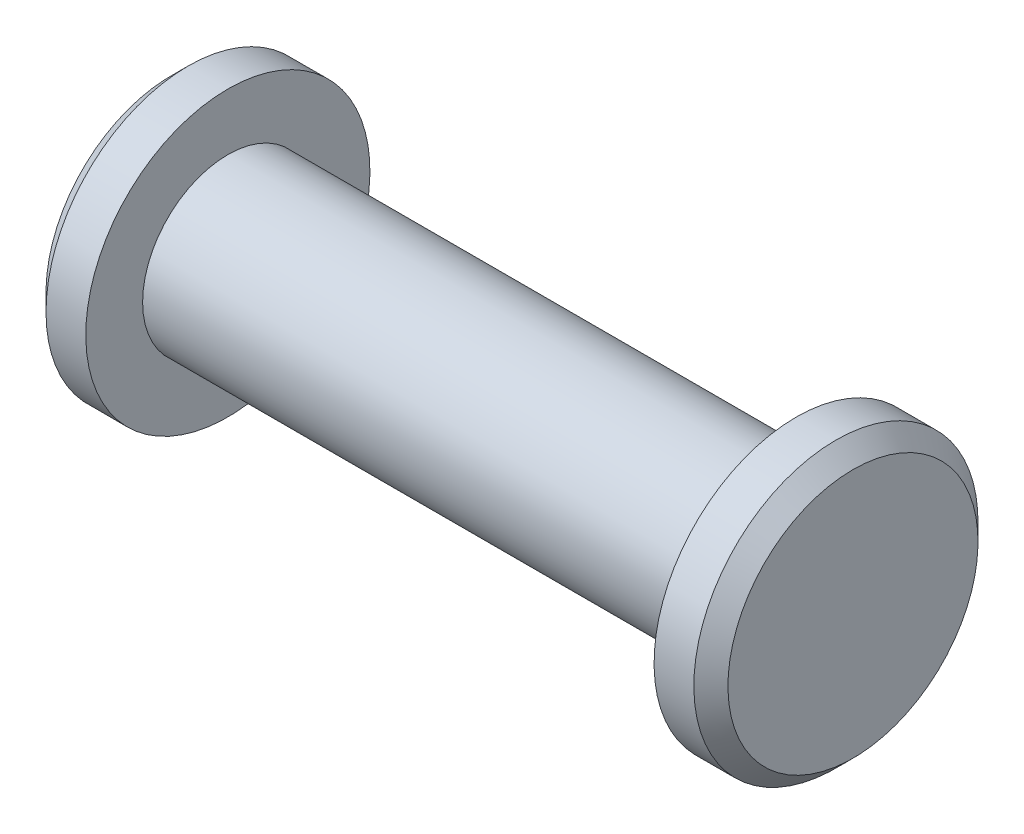
ISO-10303-21;
HEADER;
FILE_DESCRIPTION(('STEP AP214'),'2;1');
FILE_NAME('part.step','',(''),(''),'','','');
FILE_SCHEMA(('AUTOMOTIVE_DESIGN { 1 0 10303 214 1 1 1 1 }'));
ENDSEC;
DATA;
#1=APPLICATION_CONTEXT('core data for automotive mechanical design processes');
#2=APPLICATION_PROTOCOL_DEFINITION('international standard','automotive_design',2000,#1);
#3=PRODUCT_CONTEXT('',#1,'mechanical');
#4=PRODUCT('Part','Part','',(#3));
#5=PRODUCT_RELATED_PRODUCT_CATEGORY('part','',(#4));
#6=PRODUCT_DEFINITION_FORMATION('','',#4);
#7=PRODUCT_DEFINITION_CONTEXT('part definition',#1,'design');
#8=PRODUCT_DEFINITION('design','',#6,#7);
#9=PRODUCT_DEFINITION_SHAPE('','',#8);
#10=(LENGTH_UNIT() NAMED_UNIT(*) SI_UNIT(.MILLI.,.METRE.));
#11=(NAMED_UNIT(*) PLANE_ANGLE_UNIT() SI_UNIT($,.RADIAN.));
#12=(NAMED_UNIT(*) SI_UNIT($,.STERADIAN.) SOLID_ANGLE_UNIT());
#13=UNCERTAINTY_MEASURE_WITH_UNIT(LENGTH_MEASURE(1.E-05),#10,'distance_accuracy_value','');
#14=(GEOMETRIC_REPRESENTATION_CONTEXT(3) GLOBAL_UNCERTAINTY_ASSIGNED_CONTEXT((#13)) GLOBAL_UNIT_ASSIGNED_CONTEXT((#10,
#11,#12)) REPRESENTATION_CONTEXT('',''));
#15=CARTESIAN_POINT('',(0.,0.,0.));
#16=DIRECTION('',(0.,0.,1.));
#17=DIRECTION('',(1.,0.,0.));
#18=AXIS2_PLACEMENT_3D('',#15,#16,#17);
#19=CARTESIAN_POINT('',(0.,25.,0.));
#20=DIRECTION('',(1.,0.,0.));
#21=DIRECTION('',(0.,1.,0.));
#22=AXIS2_PLACEMENT_3D('',#19,#20,#21);
#23=PLANE('',#22);
#24=CARTESIAN_POINT('',(0.,0.,0.));
#25=DIRECTION('',(1.,0.,0.));
#26=DIRECTION('',(0.,1.,0.));
#27=AXIS2_PLACEMENT_3D('',#24,#25,#26);
#28=CIRCLE('',#27,22.);
#29=CARTESIAN_POINT('',(0.,22.,0.));
#30=VERTEX_POINT('',#29);
#31=EDGE_CURVE('E45',#30,#30,#28,.T.);
#32=ORIENTED_EDGE('',*,*,#31,.T.);
#33=EDGE_LOOP('',(#32));
#34=FACE_BOUND('',#33,.T.);
#35=ADVANCED_FACE('F37',(#34),#23,.T.);
#36=CARTESIAN_POINT('',(-120.,0.,0.));
#37=DIRECTION('',(-1.,0.,0.));
#38=DIRECTION('',(0.,-1.,0.));
#39=AXIS2_PLACEMENT_3D('',#36,#37,#38);
#40=PLANE('',#39);
#41=CARTESIAN_POINT('',(-120.,0.,0.));
#42=DIRECTION('',(-1.,0.,0.));
#43=DIRECTION('',(0.,-1.,0.));
#44=AXIS2_PLACEMENT_3D('',#41,#42,#43);
#45=CIRCLE('',#44,22.);
#46=CARTESIAN_POINT('',(-120.,-22.,0.));
#47=VERTEX_POINT('',#46);
#48=EDGE_CURVE('E50',#47,#47,#45,.T.);
#49=ORIENTED_EDGE('',*,*,#48,.T.);
#50=EDGE_LOOP('',(#49));
#51=FACE_BOUND('',#50,.T.);
#52=ADVANCED_FACE('F95',(#51),#40,.T.);
#53=CARTESIAN_POINT('',(0.,0.,0.));
#54=DIRECTION('',(1.,0.,0.));
#55=DIRECTION('',(0.,1.,0.));
#56=AXIS2_PLACEMENT_3D('',#53,#54,#55);
#57=CYLINDRICAL_SURFACE('',#56,25.);
#58=CARTESIAN_POINT('',(-117.,0.,0.));
#59=DIRECTION('',(-1.,0.,0.));
#60=DIRECTION('',(0.,-1.,0.));
#61=AXIS2_PLACEMENT_3D('',#58,#59,#60);
#62=CIRCLE('',#61,25.);
#63=CARTESIAN_POINT('',(-117.,-25.,0.));
#64=VERTEX_POINT('',#63);
#65=EDGE_CURVE('E55',#64,#64,#62,.F.);
#66=ORIENTED_EDGE('',*,*,#65,.T.);
#67=EDGE_LOOP('',(#66));
#68=FACE_BOUND('',#67,.T.);
#69=CARTESIAN_POINT('',(-110.,0.,0.));
#70=DIRECTION('',(1.,0.,0.));
#71=DIRECTION('',(0.,1.,0.));
#72=AXIS2_PLACEMENT_3D('',#69,#70,#71);
#73=CIRCLE('',#72,25.);
#74=CARTESIAN_POINT('',(-110.,25.,0.));
#75=VERTEX_POINT('',#74);
#76=EDGE_CURVE('E61',#75,#75,#73,.T.);
#77=ORIENTED_EDGE('',*,*,#76,.F.);
#78=EDGE_LOOP('',(#77));
#79=FACE_BOUND('',#78,.T.);
#80=ADVANCED_FACE('F100',(#68,#79),#57,.T.);
#81=CARTESIAN_POINT('',(-110.,25.,0.));
#82=DIRECTION('',(1.,0.,0.));
#83=DIRECTION('',(0.,1.,0.));
#84=AXIS2_PLACEMENT_3D('',#81,#82,#83);
#85=PLANE('',#84);
#86=ORIENTED_EDGE('',*,*,#76,.T.);
#87=EDGE_LOOP('',(#86));
#88=FACE_BOUND('',#87,.T.);
#89=CARTESIAN_POINT('',(-110.,0.,0.));
#90=DIRECTION('',(1.,0.,0.));
#91=DIRECTION('',(0.,1.,0.));
#92=AXIS2_PLACEMENT_3D('',#89,#90,#91);
#93=CIRCLE('',#92,15.);
#94=CARTESIAN_POINT('',(-110.,15.,0.));
#95=VERTEX_POINT('',#94);
#96=EDGE_CURVE('E65',#95,#95,#93,.T.);
#97=ORIENTED_EDGE('',*,*,#96,.F.);
#98=EDGE_LOOP('',(#97));
#99=FACE_BOUND('',#98,.T.);
#100=ADVANCED_FACE('F91',(#88,#99),#85,.T.);
#101=CARTESIAN_POINT('',(0.,0.,0.));
#102=DIRECTION('',(1.,0.,0.));
#103=DIRECTION('',(0.,1.,0.));
#104=AXIS2_PLACEMENT_3D('',#101,#102,#103);
#105=CYLINDRICAL_SURFACE('',#104,15.);
#106=ORIENTED_EDGE('',*,*,#96,.T.);
#107=EDGE_LOOP('',(#106));
#108=FACE_BOUND('',#107,.T.);
#109=CARTESIAN_POINT('',(-10.,0.,0.));
#110=DIRECTION('',(1.,0.,0.));
#111=DIRECTION('',(0.,1.,0.));
#112=AXIS2_PLACEMENT_3D('',#109,#110,#111);
#113=CIRCLE('',#112,15.);
#114=CARTESIAN_POINT('',(-10.,15.,0.));
#115=VERTEX_POINT('',#114);
#116=EDGE_CURVE('E69',#115,#115,#113,.T.);
#117=ORIENTED_EDGE('',*,*,#116,.F.);
#118=EDGE_LOOP('',(#117));
#119=FACE_BOUND('',#118,.T.);
#120=ADVANCED_FACE('F82',(#108,#119),#105,.T.);
#121=CARTESIAN_POINT('',(-10.,15.,0.));
#122=DIRECTION('',(-1.,0.,0.));
#123=DIRECTION('',(0.,-1.,0.));
#124=AXIS2_PLACEMENT_3D('',#121,#122,#123);
#125=PLANE('',#124);
#126=ORIENTED_EDGE('',*,*,#116,.T.);
#127=EDGE_LOOP('',(#126));
#128=FACE_BOUND('',#127,.T.);
#129=CARTESIAN_POINT('',(-9.99999999999999,0.,0.));
#130=DIRECTION('',(1.,0.,0.));
#131=DIRECTION('',(0.,1.,0.));
#132=AXIS2_PLACEMENT_3D('',#129,#130,#131);
#133=CIRCLE('',#132,25.);
#134=CARTESIAN_POINT('',(-9.99999999999999,25.,0.));
#135=VERTEX_POINT('',#134);
#136=EDGE_CURVE('E73',#135,#135,#133,.T.);
#137=ORIENTED_EDGE('',*,*,#136,.F.);
#138=EDGE_LOOP('',(#137));
#139=FACE_BOUND('',#138,.T.);
#140=ADVANCED_FACE('F80',(#128,#139),#125,.T.);
#141=CARTESIAN_POINT('',(0.,0.,0.));
#142=DIRECTION('',(1.,0.,0.));
#143=DIRECTION('',(0.,1.,0.));
#144=AXIS2_PLACEMENT_3D('',#141,#142,#143);
#145=CYLINDRICAL_SURFACE('',#144,25.);
#146=CARTESIAN_POINT('',(-2.99999999999998,0.,0.));
#147=DIRECTION('',(1.,0.,0.));
#148=DIRECTION('',(0.,1.,0.));
#149=AXIS2_PLACEMENT_3D('',#146,#147,#148);
#150=CIRCLE('',#149,25.);
#151=CARTESIAN_POINT('',(-2.99999999999998,25.,0.));
#152=VERTEX_POINT('',#151);
#153=EDGE_CURVE('E10',#152,#152,#150,.F.);
#154=ORIENTED_EDGE('',*,*,#153,.T.);
#155=EDGE_LOOP('',(#154));
#156=FACE_BOUND('',#155,.T.);
#157=ORIENTED_EDGE('',*,*,#136,.T.);
#158=EDGE_LOOP('',(#157));
#159=FACE_BOUND('',#158,.T.);
#160=ADVANCED_FACE('F78',(#156,#159),#145,.T.);
#161=CARTESIAN_POINT('',(-117.,0.,0.));
#162=DIRECTION('',(1.,0.,0.));
#163=DIRECTION('',(0.,1.,0.));
#164=AXIS2_PLACEMENT_3D('',#161,#162,#163);
#165=CONICAL_SURFACE('',#164,25.,0.785398163397451);
#166=ORIENTED_EDGE('',*,*,#48,.F.);
#167=EDGE_LOOP('',(#166));
#168=FACE_BOUND('',#167,.T.);
#169=ORIENTED_EDGE('',*,*,#65,.F.);
#170=EDGE_LOOP('',(#169));
#171=FACE_BOUND('',#170,.T.);
#172=ADVANCED_FACE('F89',(#168,#171),#165,.T.);
#173=CARTESIAN_POINT('',(0.,0.,0.));
#174=DIRECTION('',(-1.,0.,0.));
#175=DIRECTION('',(0.,-1.,0.));
#176=AXIS2_PLACEMENT_3D('',#173,#174,#175);
#177=CONICAL_SURFACE('',#176,22.,0.785398163397448);
#178=ORIENTED_EDGE('',*,*,#153,.F.);
#179=EDGE_LOOP('',(#178));
#180=FACE_BOUND('',#179,.T.);
#181=ORIENTED_EDGE('',*,*,#31,.F.);
#182=EDGE_LOOP('',(#181));
#183=FACE_BOUND('',#182,.T.);
#184=ADVANCED_FACE('F39',(#180,#183),#177,.T.);
#185=CLOSED_SHELL('',(#35,#52,#80,#100,#120,#140,#160,#172,#184));
#186=MANIFOLD_SOLID_BREP('B2',#185);
#187=ADVANCED_BREP_SHAPE_REPRESENTATION('',(#18,#186),#14);
#188=SHAPE_DEFINITION_REPRESENTATION(#9,#187);
ENDSEC;
END-ISO-10303-21;
